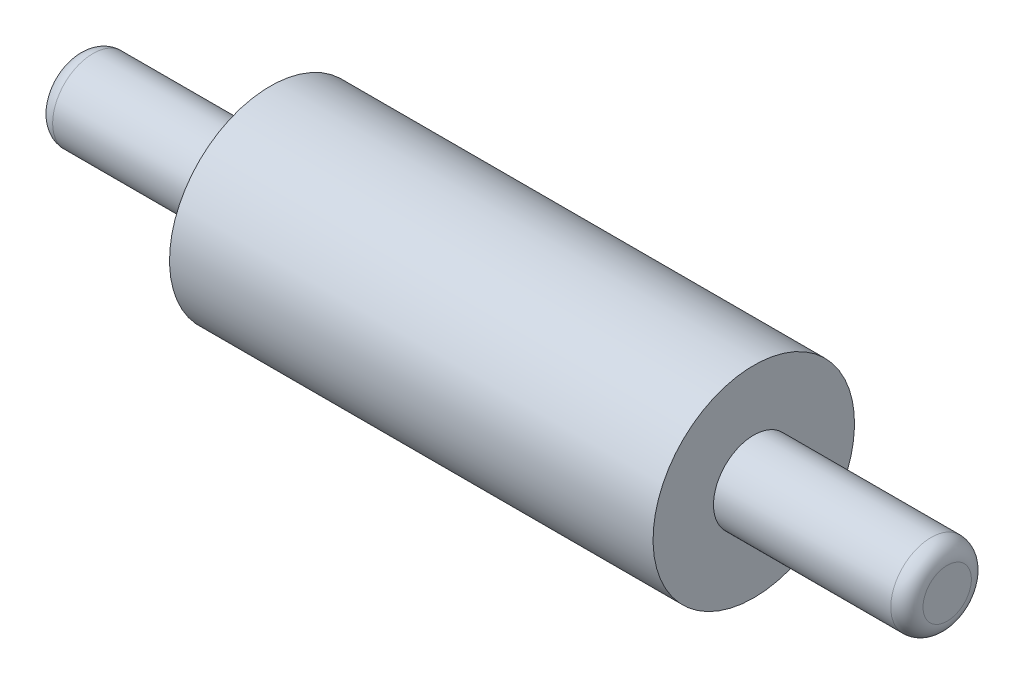
ISO-10303-21;
HEADER;
FILE_DESCRIPTION(('STEP AP214'),'2;1');
FILE_NAME('part.step','',(''),(''),'','','');
FILE_SCHEMA(('AUTOMOTIVE_DESIGN { 1 0 10303 214 1 1 1 1 }'));
ENDSEC;
DATA;
#1=APPLICATION_CONTEXT('core data for automotive mechanical design processes');
#2=APPLICATION_PROTOCOL_DEFINITION('international standard','automotive_design',2000,#1);
#3=PRODUCT_CONTEXT('',#1,'mechanical');
#4=PRODUCT('Part','Part','',(#3));
#5=PRODUCT_RELATED_PRODUCT_CATEGORY('part','',(#4));
#6=PRODUCT_DEFINITION_FORMATION('','',#4);
#7=PRODUCT_DEFINITION_CONTEXT('part definition',#1,'design');
#8=PRODUCT_DEFINITION('design','',#6,#7);
#9=PRODUCT_DEFINITION_SHAPE('','',#8);
#10=(LENGTH_UNIT() NAMED_UNIT(*) SI_UNIT(.MILLI.,.METRE.));
#11=(NAMED_UNIT(*) PLANE_ANGLE_UNIT() SI_UNIT($,.RADIAN.));
#12=(NAMED_UNIT(*) SI_UNIT($,.STERADIAN.) SOLID_ANGLE_UNIT());
#13=UNCERTAINTY_MEASURE_WITH_UNIT(LENGTH_MEASURE(1.E-05),#10,'distance_accuracy_value','');
#14=(GEOMETRIC_REPRESENTATION_CONTEXT(3) GLOBAL_UNCERTAINTY_ASSIGNED_CONTEXT((#13)) GLOBAL_UNIT_ASSIGNED_CONTEXT((#10,
#11,#12)) REPRESENTATION_CONTEXT('',''));
#15=CARTESIAN_POINT('',(0.,0.,0.));
#16=DIRECTION('',(0.,0.,1.));
#17=DIRECTION('',(1.,0.,0.));
#18=AXIS2_PLACEMENT_3D('',#15,#16,#17);
#19=CARTESIAN_POINT('',(-68.58,6.34999999999999,0.));
#20=DIRECTION('',(1.,0.,0.));
#21=DIRECTION('',(0.,1.,0.));
#22=AXIS2_PLACEMENT_3D('',#19,#20,#21);
#23=PLANE('',#22);
#24=CARTESIAN_POINT('',(-68.58,0.,0.));
#25=DIRECTION('',(1.,0.,0.));
#26=DIRECTION('',(0.,1.,0.));
#27=AXIS2_PLACEMENT_3D('',#24,#25,#26);
#28=CIRCLE('',#27,3.80999999999999);
#29=CARTESIAN_POINT('',(-68.58,3.80999999999999,0.));
#30=VERTEX_POINT('',#29);
#31=EDGE_CURVE('E55',#30,#30,#28,.F.);
#32=ORIENTED_EDGE('',*,*,#31,.T.);
#33=EDGE_LOOP('',(#32));
#34=FACE_BOUND('',#33,.T.);
#35=ADVANCED_FACE('F37',(#34),#23,.F.);
#36=CARTESIAN_POINT('',(68.58,0.,0.));
#37=DIRECTION('',(-1.,0.,0.));
#38=DIRECTION('',(0.,-1.,0.));
#39=AXIS2_PLACEMENT_3D('',#36,#37,#38);
#40=PLANE('',#39);
#41=CARTESIAN_POINT('',(68.58,0.,0.));
#42=DIRECTION('',(-1.,0.,0.));
#43=DIRECTION('',(0.,-1.,0.));
#44=AXIS2_PLACEMENT_3D('',#41,#42,#43);
#45=CIRCLE('',#44,3.81);
#46=CARTESIAN_POINT('',(68.58,-3.81,0.));
#47=VERTEX_POINT('',#46);
#48=EDGE_CURVE('E10',#47,#47,#45,.F.);
#49=ORIENTED_EDGE('',*,*,#48,.T.);
#50=EDGE_LOOP('',(#49));
#51=FACE_BOUND('',#50,.T.);
#52=ADVANCED_FACE('F100',(#51),#40,.F.);
#53=CARTESIAN_POINT('',(-68.58,0.,0.));
#54=DIRECTION('',(-1.,0.,0.));
#55=DIRECTION('',(0.,-1.,0.));
#56=AXIS2_PLACEMENT_3D('',#53,#54,#55);
#57=CYLINDRICAL_SURFACE('',#56,6.35);
#58=CARTESIAN_POINT('',(66.04,0.,0.));
#59=DIRECTION('',(-1.,0.,0.));
#60=DIRECTION('',(0.,-1.,0.));
#61=AXIS2_PLACEMENT_3D('',#58,#59,#60);
#62=CIRCLE('',#61,6.35);
#63=CARTESIAN_POINT('',(66.04,-6.35,0.));
#64=VERTEX_POINT('',#63);
#65=EDGE_CURVE('E45',#64,#64,#62,.T.);
#66=ORIENTED_EDGE('',*,*,#65,.T.);
#67=EDGE_LOOP('',(#66));
#68=FACE_BOUND('',#67,.T.);
#69=CARTESIAN_POINT('',(38.1,0.,0.));
#70=DIRECTION('',(-1.,0.,0.));
#71=DIRECTION('',(0.,-1.,0.));
#72=AXIS2_PLACEMENT_3D('',#69,#70,#71);
#73=CIRCLE('',#72,6.35);
#74=CARTESIAN_POINT('',(38.1,-6.35000000000001,0.));
#75=VERTEX_POINT('',#74);
#76=EDGE_CURVE('E61',#75,#75,#73,.T.);
#77=ORIENTED_EDGE('',*,*,#76,.F.);
#78=EDGE_LOOP('',(#77));
#79=FACE_BOUND('',#78,.T.);
#80=ADVANCED_FACE('F95',(#68,#79),#57,.T.);
#81=CARTESIAN_POINT('',(38.1,6.34999999999999,0.));
#82=DIRECTION('',(-1.,0.,0.));
#83=DIRECTION('',(0.,-1.,0.));
#84=AXIS2_PLACEMENT_3D('',#81,#82,#83);
#85=PLANE('',#84);
#86=CARTESIAN_POINT('',(38.1,0.,0.));
#87=DIRECTION('',(-1.,0.,0.));
#88=DIRECTION('',(0.,-1.,0.));
#89=AXIS2_PLACEMENT_3D('',#86,#87,#88);
#90=CIRCLE('',#89,15.875);
#91=CARTESIAN_POINT('',(38.1,-15.875,0.));
#92=VERTEX_POINT('',#91);
#93=EDGE_CURVE('E65',#92,#92,#90,.T.);
#94=ORIENTED_EDGE('',*,*,#93,.F.);
#95=EDGE_LOOP('',(#94));
#96=FACE_BOUND('',#95,.T.);
#97=ORIENTED_EDGE('',*,*,#76,.T.);
#98=EDGE_LOOP('',(#97));
#99=FACE_BOUND('',#98,.T.);
#100=ADVANCED_FACE('F89',(#96,#99),#85,.F.);
#101=CARTESIAN_POINT('',(-68.58,0.,0.));
#102=DIRECTION('',(-1.,0.,0.));
#103=DIRECTION('',(0.,-1.,0.));
#104=AXIS2_PLACEMENT_3D('',#101,#102,#103);
#105=CYLINDRICAL_SURFACE('',#104,15.875);
#106=CARTESIAN_POINT('',(-38.1,0.,0.));
#107=DIRECTION('',(-1.,0.,0.));
#108=DIRECTION('',(0.,-1.,0.));
#109=AXIS2_PLACEMENT_3D('',#106,#107,#108);
#110=CIRCLE('',#109,15.875);
#111=CARTESIAN_POINT('',(-38.1,-15.875,0.));
#112=VERTEX_POINT('',#111);
#113=EDGE_CURVE('E69',#112,#112,#110,.T.);
#114=ORIENTED_EDGE('',*,*,#113,.F.);
#115=EDGE_LOOP('',(#114));
#116=FACE_BOUND('',#115,.T.);
#117=ORIENTED_EDGE('',*,*,#93,.T.);
#118=EDGE_LOOP('',(#117));
#119=FACE_BOUND('',#118,.T.);
#120=ADVANCED_FACE('F83',(#116,#119),#105,.T.);
#121=CARTESIAN_POINT('',(-38.1,15.875,0.));
#122=DIRECTION('',(1.,0.,0.));
#123=DIRECTION('',(0.,1.,0.));
#124=AXIS2_PLACEMENT_3D('',#121,#122,#123);
#125=PLANE('',#124);
#126=CARTESIAN_POINT('',(-38.1,0.,0.));
#127=DIRECTION('',(-1.,0.,0.));
#128=DIRECTION('',(0.,-1.,0.));
#129=AXIS2_PLACEMENT_3D('',#126,#127,#128);
#130=CIRCLE('',#129,6.35);
#131=CARTESIAN_POINT('',(-38.1,-6.35,0.));
#132=VERTEX_POINT('',#131);
#133=EDGE_CURVE('E73',#132,#132,#130,.T.);
#134=ORIENTED_EDGE('',*,*,#133,.F.);
#135=EDGE_LOOP('',(#134));
#136=FACE_BOUND('',#135,.T.);
#137=ORIENTED_EDGE('',*,*,#113,.T.);
#138=EDGE_LOOP('',(#137));
#139=FACE_BOUND('',#138,.T.);
#140=ADVANCED_FACE('F80',(#136,#139),#125,.F.);
#141=CARTESIAN_POINT('',(-68.58,0.,0.));
#142=DIRECTION('',(-1.,0.,0.));
#143=DIRECTION('',(0.,-1.,0.));
#144=AXIS2_PLACEMENT_3D('',#141,#142,#143);
#145=CYLINDRICAL_SURFACE('',#144,6.34999999999999);
#146=CARTESIAN_POINT('',(-66.04,0.,0.));
#147=DIRECTION('',(1.,0.,0.));
#148=DIRECTION('',(0.,1.,0.));
#149=AXIS2_PLACEMENT_3D('',#146,#147,#148);
#150=CIRCLE('',#149,6.34999999999999);
#151=CARTESIAN_POINT('',(-66.04,6.34999999999999,0.));
#152=VERTEX_POINT('',#151);
#153=EDGE_CURVE('E50',#152,#152,#150,.T.);
#154=ORIENTED_EDGE('',*,*,#153,.T.);
#155=EDGE_LOOP('',(#154));
#156=FACE_BOUND('',#155,.T.);
#157=ORIENTED_EDGE('',*,*,#133,.T.);
#158=EDGE_LOOP('',(#157));
#159=FACE_BOUND('',#158,.T.);
#160=ADVANCED_FACE('F78',(#156,#159),#145,.T.);
#161=CARTESIAN_POINT('',(-66.04,0.,0.));
#162=DIRECTION('',(1.,0.,0.));
#163=DIRECTION('',(0.,1.,0.));
#164=AXIS2_PLACEMENT_3D('',#161,#162,#163);
#165=TOROIDAL_SURFACE('',#164,3.80999999999999,2.54);
#166=ORIENTED_EDGE('',*,*,#153,.F.);
#167=EDGE_LOOP('',(#166));
#168=FACE_BOUND('',#167,.T.);
#169=ORIENTED_EDGE('',*,*,#31,.F.);
#170=EDGE_LOOP('',(#169));
#171=FACE_BOUND('',#170,.T.);
#172=ADVANCED_FACE('F111',(#168,#171),#165,.T.);
#173=CARTESIAN_POINT('',(66.04,0.,0.));
#174=DIRECTION('',(-1.,0.,0.));
#175=DIRECTION('',(0.,-1.,0.));
#176=AXIS2_PLACEMENT_3D('',#173,#174,#175);
#177=TOROIDAL_SURFACE('',#176,3.81,2.54);
#178=ORIENTED_EDGE('',*,*,#48,.F.);
#179=EDGE_LOOP('',(#178));
#180=FACE_BOUND('',#179,.T.);
#181=ORIENTED_EDGE('',*,*,#65,.F.);
#182=EDGE_LOOP('',(#181));
#183=FACE_BOUND('',#182,.T.);
#184=ADVANCED_FACE('F39',(#180,#183),#177,.T.);
#185=CLOSED_SHELL('',(#35,#52,#80,#100,#120,#140,#160,#172,#184));
#186=MANIFOLD_SOLID_BREP('B2',#185);
#187=ADVANCED_BREP_SHAPE_REPRESENTATION('',(#18,#186),#14);
#188=SHAPE_DEFINITION_REPRESENTATION(#9,#187);
ENDSEC;
END-ISO-10303-21;
